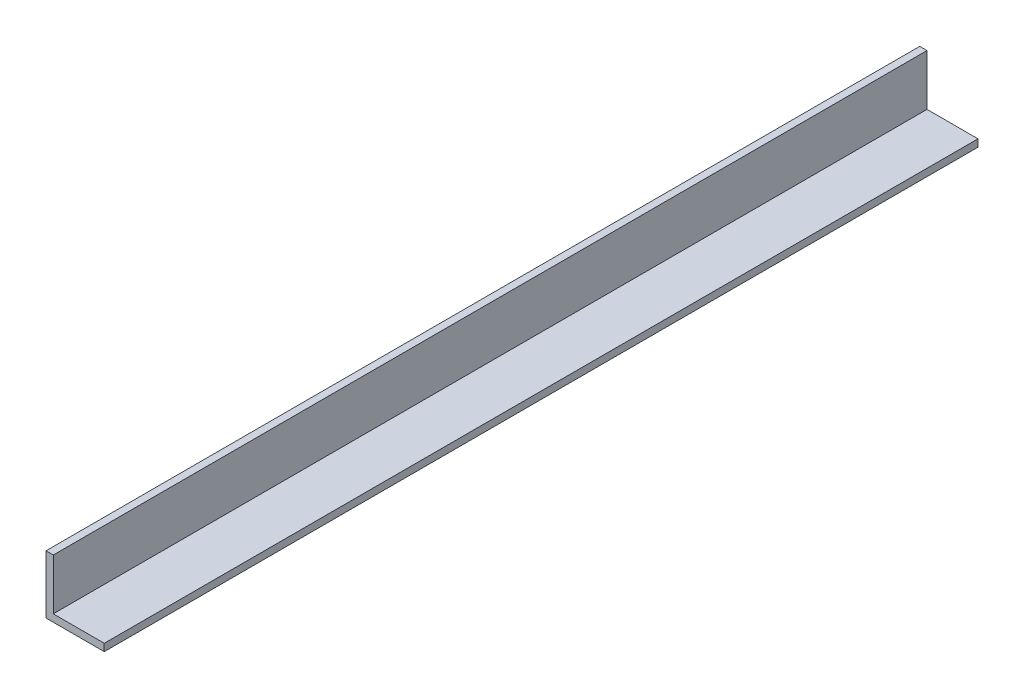
ISO-10303-21;
HEADER;
FILE_DESCRIPTION(('STEP AP214'),'2;1');
FILE_NAME('part.step','',(''),(''),'','','');
FILE_SCHEMA(('AUTOMOTIVE_DESIGN { 1 0 10303 214 1 1 1 1 }'));
ENDSEC;
DATA;
#1=APPLICATION_CONTEXT('core data for automotive mechanical design processes');
#2=APPLICATION_PROTOCOL_DEFINITION('international standard','automotive_design',2000,#1);
#3=PRODUCT_CONTEXT('',#1,'mechanical');
#4=PRODUCT('Part','Part','',(#3));
#5=PRODUCT_RELATED_PRODUCT_CATEGORY('part','',(#4));
#6=PRODUCT_DEFINITION_FORMATION('','',#4);
#7=PRODUCT_DEFINITION_CONTEXT('part definition',#1,'design');
#8=PRODUCT_DEFINITION('design','',#6,#7);
#9=PRODUCT_DEFINITION_SHAPE('','',#8);
#10=(LENGTH_UNIT() NAMED_UNIT(*) SI_UNIT(.MILLI.,.METRE.));
#11=(NAMED_UNIT(*) PLANE_ANGLE_UNIT() SI_UNIT($,.RADIAN.));
#12=(NAMED_UNIT(*) SI_UNIT($,.STERADIAN.) SOLID_ANGLE_UNIT());
#13=UNCERTAINTY_MEASURE_WITH_UNIT(LENGTH_MEASURE(1.E-05),#10,'distance_accuracy_value','');
#14=(GEOMETRIC_REPRESENTATION_CONTEXT(3) GLOBAL_UNCERTAINTY_ASSIGNED_CONTEXT((#13)) GLOBAL_UNIT_ASSIGNED_CONTEXT((#10,
#11,#12)) REPRESENTATION_CONTEXT('',''));
#15=CARTESIAN_POINT('',(0.,0.,0.));
#16=DIRECTION('',(0.,0.,1.));
#17=DIRECTION('',(1.,0.,0.));
#18=AXIS2_PLACEMENT_3D('',#15,#16,#17);
#19=CARTESIAN_POINT('',(0.,0.,381.));
#20=DIRECTION('',(1.,0.,0.));
#21=DIRECTION('',(0.,0.,-1.));
#22=AXIS2_PLACEMENT_3D('',#19,#20,#21);
#23=PLANE('',#22);
#24=DIRECTION('',(0.,-1.,0.));
#25=VECTOR('',#24,1.);
#26=CARTESIAN_POINT('',(0.,0.,0.));
#27=LINE('',#26,#25);
#28=CARTESIAN_POINT('',(0.,25.4,0.));
#29=VERTEX_POINT('',#28);
#30=CARTESIAN_POINT('',(0.,0.,0.));
#31=VERTEX_POINT('',#30);
#32=EDGE_CURVE('E119',#29,#31,#27,.T.);
#33=ORIENTED_EDGE('',*,*,#32,.T.);
#34=DIRECTION('',(0.,0.,-1.));
#35=VECTOR('',#34,1.);
#36=CARTESIAN_POINT('',(0.,0.,381.));
#37=LINE('',#36,#35);
#38=CARTESIAN_POINT('',(0.,0.,381.));
#39=VERTEX_POINT('',#38);
#40=EDGE_CURVE('E11',#39,#31,#37,.T.);
#41=ORIENTED_EDGE('',*,*,#40,.F.);
#42=DIRECTION('',(0.,-1.,0.));
#43=VECTOR('',#42,1.);
#44=CARTESIAN_POINT('',(0.,0.,381.));
#45=LINE('',#44,#43);
#46=CARTESIAN_POINT('',(0.,25.4,381.));
#47=VERTEX_POINT('',#46);
#48=EDGE_CURVE('E129',#47,#39,#45,.T.);
#49=ORIENTED_EDGE('',*,*,#48,.F.);
#50=DIRECTION('',(0.,0.,-1.));
#51=VECTOR('',#50,1.);
#52=CARTESIAN_POINT('',(0.,25.4,381.));
#53=LINE('',#52,#51);
#54=EDGE_CURVE('E115',#47,#29,#53,.T.);
#55=ORIENTED_EDGE('',*,*,#54,.T.);
#56=EDGE_LOOP('',(#33,#41,#49,#55));
#57=FACE_BOUND('',#56,.T.);
#58=ADVANCED_FACE('F35',(#57),#23,.F.);
#59=CARTESIAN_POINT('',(0.,0.,381.));
#60=DIRECTION('',(0.,1.,0.));
#61=DIRECTION('',(0.,0.,1.));
#62=AXIS2_PLACEMENT_3D('',#59,#60,#61);
#63=PLANE('',#62);
#64=DIRECTION('',(1.,0.,0.));
#65=VECTOR('',#64,1.);
#66=CARTESIAN_POINT('',(0.,0.,0.));
#67=LINE('',#66,#65);
#68=CARTESIAN_POINT('',(25.4,0.,0.));
#69=VERTEX_POINT('',#68);
#70=EDGE_CURVE('E122',#31,#69,#67,.T.);
#71=ORIENTED_EDGE('',*,*,#70,.T.);
#72=DIRECTION('',(0.,0.,-1.));
#73=VECTOR('',#72,1.);
#74=CARTESIAN_POINT('',(25.4,0.,381.));
#75=LINE('',#74,#73);
#76=CARTESIAN_POINT('',(25.4,0.,381.));
#77=VERTEX_POINT('',#76);
#78=EDGE_CURVE('E43',#77,#69,#75,.T.);
#79=ORIENTED_EDGE('',*,*,#78,.F.);
#80=DIRECTION('',(1.,0.,0.));
#81=VECTOR('',#80,1.);
#82=CARTESIAN_POINT('',(0.,0.,381.));
#83=LINE('',#82,#81);
#84=EDGE_CURVE('E88',#39,#77,#83,.T.);
#85=ORIENTED_EDGE('',*,*,#84,.F.);
#86=ORIENTED_EDGE('',*,*,#40,.T.);
#87=EDGE_LOOP('',(#71,#79,#85,#86));
#88=FACE_BOUND('',#87,.T.);
#89=ADVANCED_FACE('F153',(#88),#63,.F.);
#90=CARTESIAN_POINT('',(25.4,0.,381.));
#91=DIRECTION('',(-1.,0.,0.));
#92=DIRECTION('',(0.,0.,1.));
#93=AXIS2_PLACEMENT_3D('',#90,#91,#92);
#94=PLANE('',#93);
#95=DIRECTION('',(0.,1.,0.));
#96=VECTOR('',#95,1.);
#97=CARTESIAN_POINT('',(25.4,0.,0.));
#98=LINE('',#97,#96);
#99=CARTESIAN_POINT('',(25.4,3.175,0.));
#100=VERTEX_POINT('',#99);
#101=EDGE_CURVE('E124',#69,#100,#98,.T.);
#102=ORIENTED_EDGE('',*,*,#101,.T.);
#103=DIRECTION('',(0.,0.,-1.));
#104=VECTOR('',#103,1.);
#105=CARTESIAN_POINT('',(25.4,3.175,381.));
#106=LINE('',#105,#104);
#107=CARTESIAN_POINT('',(25.4,3.175,381.));
#108=VERTEX_POINT('',#107);
#109=EDGE_CURVE('E110',#108,#100,#106,.T.);
#110=ORIENTED_EDGE('',*,*,#109,.F.);
#111=DIRECTION('',(0.,1.,0.));
#112=VECTOR('',#111,1.);
#113=CARTESIAN_POINT('',(25.4,0.,381.));
#114=LINE('',#113,#112);
#115=EDGE_CURVE('E101',#77,#108,#114,.T.);
#116=ORIENTED_EDGE('',*,*,#115,.F.);
#117=ORIENTED_EDGE('',*,*,#78,.T.);
#118=EDGE_LOOP('',(#102,#110,#116,#117));
#119=FACE_BOUND('',#118,.T.);
#120=ADVANCED_FACE('F135',(#119),#94,.F.);
#121=CARTESIAN_POINT('',(25.4,3.175,381.));
#122=DIRECTION('',(0.,-1.,0.));
#123=DIRECTION('',(1.,0.,0.));
#124=AXIS2_PLACEMENT_3D('',#121,#122,#123);
#125=PLANE('',#124);
#126=DIRECTION('',(-1.,0.,0.));
#127=VECTOR('',#126,1.);
#128=CARTESIAN_POINT('',(25.4,3.175,0.));
#129=LINE('',#128,#127);
#130=CARTESIAN_POINT('',(3.175,3.175,0.));
#131=VERTEX_POINT('',#130);
#132=EDGE_CURVE('E109',#100,#131,#129,.T.);
#133=ORIENTED_EDGE('',*,*,#132,.T.);
#134=DIRECTION('',(0.,0.,-1.));
#135=VECTOR('',#134,1.);
#136=CARTESIAN_POINT('',(3.175,3.175,381.));
#137=LINE('',#136,#135);
#138=CARTESIAN_POINT('',(3.175,3.175,381.));
#139=VERTEX_POINT('',#138);
#140=EDGE_CURVE('E106',#139,#131,#137,.T.);
#141=ORIENTED_EDGE('',*,*,#140,.F.);
#142=DIRECTION('',(-1.,0.,0.));
#143=VECTOR('',#142,1.);
#144=CARTESIAN_POINT('',(25.4,3.175,381.));
#145=LINE('',#144,#143);
#146=EDGE_CURVE('E95',#108,#139,#145,.T.);
#147=ORIENTED_EDGE('',*,*,#146,.F.);
#148=ORIENTED_EDGE('',*,*,#109,.T.);
#149=EDGE_LOOP('',(#133,#141,#147,#148));
#150=FACE_BOUND('',#149,.T.);
#151=ADVANCED_FACE('F107',(#150),#125,.F.);
#152=CARTESIAN_POINT('',(3.175,25.4,381.));
#153=DIRECTION('',(-1.,0.,0.));
#154=DIRECTION('',(0.,-1.,0.));
#155=AXIS2_PLACEMENT_3D('',#152,#153,#154);
#156=PLANE('',#155);
#157=DIRECTION('',(0.,1.,0.));
#158=VECTOR('',#157,1.);
#159=CARTESIAN_POINT('',(3.175,25.4,0.));
#160=LINE('',#159,#158);
#161=CARTESIAN_POINT('',(3.175,25.4,0.));
#162=VERTEX_POINT('',#161);
#163=EDGE_CURVE('E74',#131,#162,#160,.T.);
#164=ORIENTED_EDGE('',*,*,#163,.T.);
#165=DIRECTION('',(0.,0.,-1.));
#166=VECTOR('',#165,1.);
#167=CARTESIAN_POINT('',(3.175,25.4,381.));
#168=LINE('',#167,#166);
#169=CARTESIAN_POINT('',(3.175,25.4,381.));
#170=VERTEX_POINT('',#169);
#171=EDGE_CURVE('E111',#170,#162,#168,.T.);
#172=ORIENTED_EDGE('',*,*,#171,.F.);
#173=DIRECTION('',(0.,1.,0.));
#174=VECTOR('',#173,1.);
#175=CARTESIAN_POINT('',(3.175,25.4,381.));
#176=LINE('',#175,#174);
#177=EDGE_CURVE('E99',#139,#170,#176,.T.);
#178=ORIENTED_EDGE('',*,*,#177,.F.);
#179=ORIENTED_EDGE('',*,*,#140,.T.);
#180=EDGE_LOOP('',(#164,#172,#178,#179));
#181=FACE_BOUND('',#180,.T.);
#182=ADVANCED_FACE('F113',(#181),#156,.F.);
#183=CARTESIAN_POINT('',(0.,25.4,381.));
#184=DIRECTION('',(0.,-1.,0.));
#185=DIRECTION('',(0.,0.,-1.));
#186=AXIS2_PLACEMENT_3D('',#183,#184,#185);
#187=PLANE('',#186);
#188=DIRECTION('',(-1.,0.,0.));
#189=VECTOR('',#188,1.);
#190=CARTESIAN_POINT('',(0.,25.4,0.));
#191=LINE('',#190,#189);
#192=EDGE_CURVE('E80',#162,#29,#191,.T.);
#193=ORIENTED_EDGE('',*,*,#192,.T.);
#194=ORIENTED_EDGE('',*,*,#54,.F.);
#195=DIRECTION('',(-1.,0.,0.));
#196=VECTOR('',#195,1.);
#197=CARTESIAN_POINT('',(0.,25.4,381.));
#198=LINE('',#197,#196);
#199=EDGE_CURVE('E51',#170,#47,#198,.T.);
#200=ORIENTED_EDGE('',*,*,#199,.F.);
#201=ORIENTED_EDGE('',*,*,#171,.T.);
#202=EDGE_LOOP('',(#193,#194,#200,#201));
#203=FACE_BOUND('',#202,.T.);
#204=ADVANCED_FACE('F142',(#203),#187,.F.);
#205=CARTESIAN_POINT('',(0.,0.,381.));
#206=DIRECTION('',(0.,0.,-1.));
#207=DIRECTION('',(-1.,0.,0.));
#208=AXIS2_PLACEMENT_3D('',#205,#206,#207);
#209=PLANE('',#208);
#210=ORIENTED_EDGE('',*,*,#48,.T.);
#211=ORIENTED_EDGE('',*,*,#84,.T.);
#212=ORIENTED_EDGE('',*,*,#115,.T.);
#213=ORIENTED_EDGE('',*,*,#146,.T.);
#214=ORIENTED_EDGE('',*,*,#177,.T.);
#215=ORIENTED_EDGE('',*,*,#199,.T.);
#216=EDGE_LOOP('',(#210,#211,#212,#213,#214,#215));
#217=FACE_BOUND('',#216,.T.);
#218=ADVANCED_FACE('F97',(#217),#209,.F.);
#219=CARTESIAN_POINT('',(0.,0.,0.));
#220=DIRECTION('',(0.,0.,-1.));
#221=DIRECTION('',(-1.,0.,0.));
#222=AXIS2_PLACEMENT_3D('',#219,#220,#221);
#223=PLANE('',#222);
#224=ORIENTED_EDGE('',*,*,#32,.F.);
#225=ORIENTED_EDGE('',*,*,#192,.F.);
#226=ORIENTED_EDGE('',*,*,#163,.F.);
#227=ORIENTED_EDGE('',*,*,#132,.F.);
#228=ORIENTED_EDGE('',*,*,#101,.F.);
#229=ORIENTED_EDGE('',*,*,#70,.F.);
#230=EDGE_LOOP('',(#224,#225,#226,#227,#228,#229));
#231=FACE_BOUND('',#230,.T.);
#232=ADVANCED_FACE('F138',(#231),#223,.T.);
#233=CLOSED_SHELL('',(#58,#89,#120,#151,#182,#204,#218,#232));
#234=MANIFOLD_SOLID_BREP('B2',#233);
#235=ADVANCED_BREP_SHAPE_REPRESENTATION('',(#18,#234),#14);
#236=SHAPE_DEFINITION_REPRESENTATION(#9,#235);
ENDSEC;
END-ISO-10303-21;
